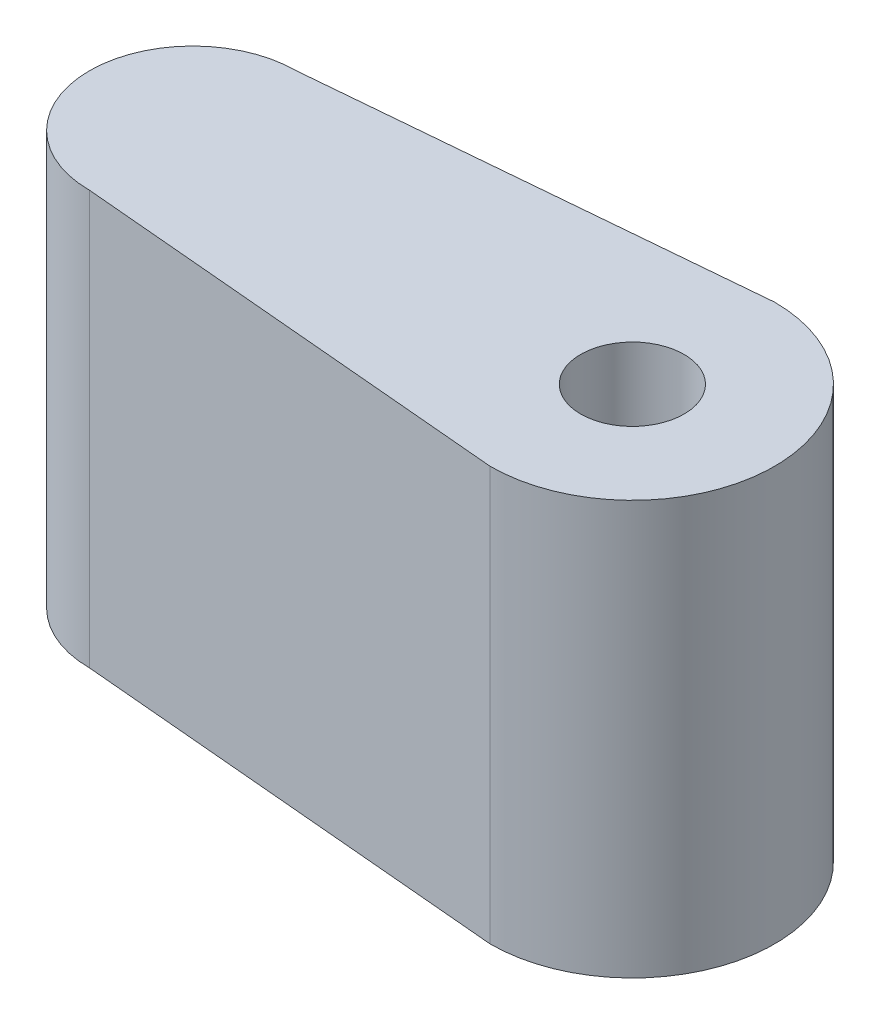
ISO-10303-21;
HEADER;
FILE_DESCRIPTION(('STEP AP214'),'2;1');
FILE_NAME('part.step','',(''),(''),'','','');
FILE_SCHEMA(('AUTOMOTIVE_DESIGN { 1 0 10303 214 1 1 1 1 }'));
ENDSEC;
DATA;
#1=APPLICATION_CONTEXT('core data for automotive mechanical design processes');
#2=APPLICATION_PROTOCOL_DEFINITION('international standard','automotive_design',2000,#1);
#3=PRODUCT_CONTEXT('',#1,'mechanical');
#4=PRODUCT('Part','Part','',(#3));
#5=PRODUCT_RELATED_PRODUCT_CATEGORY('part','',(#4));
#6=PRODUCT_DEFINITION_FORMATION('','',#4);
#7=PRODUCT_DEFINITION_CONTEXT('part definition',#1,'design');
#8=PRODUCT_DEFINITION('design','',#6,#7);
#9=PRODUCT_DEFINITION_SHAPE('','',#8);
#10=(LENGTH_UNIT() NAMED_UNIT(*) SI_UNIT(.MILLI.,.METRE.));
#11=(NAMED_UNIT(*) PLANE_ANGLE_UNIT() SI_UNIT($,.RADIAN.));
#12=(NAMED_UNIT(*) SI_UNIT($,.STERADIAN.) SOLID_ANGLE_UNIT());
#13=UNCERTAINTY_MEASURE_WITH_UNIT(LENGTH_MEASURE(1.E-05),#10,'distance_accuracy_value','');
#14=(GEOMETRIC_REPRESENTATION_CONTEXT(3) GLOBAL_UNCERTAINTY_ASSIGNED_CONTEXT((#13)) GLOBAL_UNIT_ASSIGNED_CONTEXT((#10,
#11,#12)) REPRESENTATION_CONTEXT('',''));
#15=CARTESIAN_POINT('',(0.,0.,0.));
#16=DIRECTION('',(0.,0.,1.));
#17=DIRECTION('',(1.,0.,0.));
#18=AXIS2_PLACEMENT_3D('',#15,#16,#17);
#19=CARTESIAN_POINT('',(-0.240772532188841,8.,-2.72875536480687));
#20=DIRECTION('',(-0.087893810296357,0.,-0.996129850025381));
#21=DIRECTION('',(-0.996129850025381,0.,0.087893810296357));
#22=AXIS2_PLACEMENT_3D('',#19,#20,#21);
#23=PLANE('',#22);
#24=DIRECTION('',(0.996129850025381,0.,-0.087893810296357));
#25=VECTOR('',#24,1.);
#26=CARTESIAN_POINT('',(-0.240772532188841,0.,-2.72875536480687));
#27=LINE('',#26,#25);
#28=CARTESIAN_POINT('',(-8.5,0.,-2.));
#29=VERTEX_POINT('',#28);
#30=CARTESIAN_POINT('',(0.,0.,-2.75));
#31=VERTEX_POINT('',#30);
#32=EDGE_CURVE('E130',#29,#31,#27,.T.);
#33=ORIENTED_EDGE('',*,*,#32,.F.);
#34=DIRECTION('',(0.,-1.,0.));
#35=VECTOR('',#34,1.);
#36=CARTESIAN_POINT('',(-8.5,8.,-2.));
#37=LINE('',#36,#35);
#38=CARTESIAN_POINT('',(-8.5,8.,-2.));
#39=VERTEX_POINT('',#38);
#40=EDGE_CURVE('E56',#39,#29,#37,.T.);
#41=ORIENTED_EDGE('',*,*,#40,.F.);
#42=DIRECTION('',(0.996129850025381,0.,-0.087893810296357));
#43=VECTOR('',#42,1.);
#44=CARTESIAN_POINT('',(-0.240772532188841,8.,-2.72875536480687));
#45=LINE('',#44,#43);
#46=CARTESIAN_POINT('',(0.,8.,-2.75));
#47=VERTEX_POINT('',#46);
#48=EDGE_CURVE('E107',#39,#47,#45,.T.);
#49=ORIENTED_EDGE('',*,*,#48,.T.);
#50=DIRECTION('',(0.,-1.,0.));
#51=VECTOR('',#50,1.);
#52=CARTESIAN_POINT('',(0.,8.,-2.75));
#53=LINE('',#52,#51);
#54=EDGE_CURVE('E87',#47,#31,#53,.T.);
#55=ORIENTED_EDGE('',*,*,#54,.T.);
#56=EDGE_LOOP('',(#33,#41,#49,#55));
#57=FACE_BOUND('',#56,.T.);
#58=ADVANCED_FACE('F41',(#57),#23,.T.);
#59=CARTESIAN_POINT('',(-8.5,8.,0.));
#60=DIRECTION('',(0.,-1.,0.));
#61=DIRECTION('',(0.,0.,-1.));
#62=AXIS2_PLACEMENT_3D('',#59,#60,#61);
#63=CYLINDRICAL_SURFACE('',#62,2.);
#64=CARTESIAN_POINT('',(-10.2320508075689,4.,1.));
#65=CARTESIAN_POINT('',(-10.2320553472846,3.94789219180475,0.999996363074532));
#66=CARTESIAN_POINT('',(-10.2344380118776,3.89571858847495,0.995899970733217));
#67=CARTESIAN_POINT('',(-10.2436236645205,3.79297273532285,0.979723209898053));
#68=CARTESIAN_POINT('',(-10.2504359405556,3.74240408495659,0.967626064554179));
#69=CARTESIAN_POINT('',(-10.267493466054,3.64454833565606,0.936099948699812));
#70=CARTESIAN_POINT('',(-10.2777204347325,3.59724534752641,0.916709952493731));
#71=CARTESIAN_POINT('',(-10.3004266481686,3.50657579800328,0.871267525376372));
#72=CARTESIAN_POINT('',(-10.3129060147606,3.46320944973754,0.845214734035773));
#73=CARTESIAN_POINT('',(-10.3399686905744,3.37769427144249,0.784666540530879));
#74=CARTESIAN_POINT('',(-10.3546406363795,3.33594086432646,0.74965203614377));
#75=CARTESIAN_POINT('',(-10.3837198278571,3.25859161159329,0.673253807614468));
#76=CARTESIAN_POINT('',(-10.3981269383125,3.22299883741648,0.631866925782293));
#77=CARTESIAN_POINT('',(-10.4262147695295,3.15663284885234,0.540489563414546));
#78=CARTESIAN_POINT('',(-10.4397810641817,3.12634623214047,0.490107189012574));
#79=CARTESIAN_POINT('',(-10.4635075609953,3.07485914675424,0.384157026599504));
#80=CARTESIAN_POINT('',(-10.4736699118374,3.05365294386283,0.328592538138155));
#81=CARTESIAN_POINT('',(-10.4888046124424,3.0224953386989,0.218044943925977));
#82=CARTESIAN_POINT('',(-10.4940948022089,3.01185047364447,0.163301790488817));
#83=CARTESIAN_POINT('',(-10.5000758384607,2.99983388132496,0.0525706286978477));
#84=CARTESIAN_POINT('',(-10.5007694678459,2.99845654320429,-0.00341660584373887));
#85=CARTESIAN_POINT('',(-10.4976298191645,3.00474667397035,-0.10983252442375));
#86=CARTESIAN_POINT('',(-10.4941849589216,3.01163801552122,-0.160321199176792));
#87=CARTESIAN_POINT('',(-10.4837424525975,3.03288084390466,-0.259313771918322));
#88=CARTESIAN_POINT('',(-10.4767445406639,3.04723288897622,-0.307817521093926));
#89=CARTESIAN_POINT('',(-10.4597158328765,3.08308256608981,-0.402309391569554));
#90=CARTESIAN_POINT('',(-10.449644415292,3.10467631317207,-0.448253423515178));
#91=CARTESIAN_POINT('',(-10.4273764598669,3.15426341620149,-0.535976801513328));
#92=CARTESIAN_POINT('',(-10.4151791615748,3.18225906330235,-0.577754648838646));
#93=CARTESIAN_POINT('',(-10.3884439439923,3.24689535153302,-0.660173660898195));
#94=CARTESIAN_POINT('',(-10.3737937599818,3.28410302832601,-0.700334075029361));
#95=CARTESIAN_POINT('',(-10.3445434058681,3.36458972493018,-0.77410437029778));
#96=CARTESIAN_POINT('',(-10.3299432826563,3.40787337227406,-0.807709211574231));
#97=CARTESIAN_POINT('',(-10.3014415609248,3.50264819242409,-0.869505334642212));
#98=CARTESIAN_POINT('',(-10.2876431999071,3.55448602305421,-0.897217314978051));
#99=CARTESIAN_POINT('',(-10.2637545027858,3.662937671359,-0.943319113001231));
#100=CARTESIAN_POINT('',(-10.2536603004607,3.71954643301756,-0.961718658210889));
#101=CARTESIAN_POINT('',(-10.2394463581703,3.83121451128279,-0.98718021102504));
#102=CARTESIAN_POINT('',(-10.234916558485,3.88604111904355,-0.995025122119976));
#103=CARTESIAN_POINT('',(-10.2311791936161,3.99640134151654,-1.00151694661143));
#104=CARTESIAN_POINT('',(-10.2319678688931,4.05193442911979,-1.00017035731503));
#105=CARTESIAN_POINT('',(-10.2383433654058,4.15565391857873,-0.989036043343966));
#106=CARTESIAN_POINT('',(-10.2433958750665,4.20397945110793,-0.980187816712467));
#107=CARTESIAN_POINT('',(-10.2569402155134,4.29836778627096,-0.955696284632441));
#108=CARTESIAN_POINT('',(-10.2654331600503,4.34442985074661,-0.940050778623614));
#109=CARTESIAN_POINT('',(-10.2853622207966,4.4354113309027,-0.901647588604886));
#110=CARTESIAN_POINT('',(-10.2969164324306,4.48017901685355,-0.878594063692723));
#111=CARTESIAN_POINT('',(-10.3215611949725,4.56546927153899,-0.826287064015804));
#112=CARTESIAN_POINT('',(-10.3346525335515,4.60598964351328,-0.797030404332216));
#113=CARTESIAN_POINT('',(-10.3628799845634,4.68697876752355,-0.728837167198853));
#114=CARTESIAN_POINT('',(-10.3780658315429,4.72679715071766,-0.689145272314967));
#115=CARTESIAN_POINT('',(-10.4073423497789,4.79941223799359,-0.603404495398289));
#116=CARTESIAN_POINT('',(-10.4214326500771,4.83220657023054,-0.557353474655347));
#117=CARTESIAN_POINT('',(-10.4474136169096,4.8905737259501,-0.458535362558757));
#118=CARTESIAN_POINT('',(-10.4592364167203,4.91593311821091,-0.405623097574113));
#119=CARTESIAN_POINT('',(-10.478833549593,4.95713790385739,-0.295522364641082));
#120=CARTESIAN_POINT('',(-10.4866114367637,4.97299165136631,-0.238337701392176));
#121=CARTESIAN_POINT('',(-10.4966750818188,4.99336856417466,-0.126979682330417));
#122=CARTESIAN_POINT('',(-10.4993992790819,4.99879787587611,-0.0730114438504569));
#123=CARTESIAN_POINT('',(-10.5004213037513,5.0008432654544,0.0351259859512038));
#124=CARTESIAN_POINT('',(-10.4987206806689,4.99746242852356,0.089295100295087));
#125=CARTESIAN_POINT('',(-10.4913396883792,4.98258359320438,0.192537992317147));
#126=CARTESIAN_POINT('',(-10.4859289466799,4.97163515074233,0.241712317811264));
#127=CARTESIAN_POINT('',(-10.4719209366342,4.94267300069703,0.337445952183618));
#128=CARTESIAN_POINT('',(-10.463323211328,4.92465827990655,0.384004884955509));
#129=CARTESIAN_POINT('',(-10.4432593074812,4.88127294783403,0.475423406244885));
#130=CARTESIAN_POINT('',(-10.431686171988,4.85562067679216,0.520125142700046));
#131=CARTESIAN_POINT('',(-10.4068813314183,4.79804206914095,0.604774641814024));
#132=CARTESIAN_POINT('',(-10.3936488655836,4.76611285088433,0.644720207414907));
#133=CARTESIAN_POINT('',(-10.3652861022663,4.6932028609773,0.722914004156891));
#134=CARTESIAN_POINT('',(-10.350097990117,4.65163751252281,0.760597684539272));
#135=CARTESIAN_POINT('',(-10.3206307616285,4.56254927887023,0.828663287394675));
#136=CARTESIAN_POINT('',(-10.3063524576187,4.51502117913232,0.859038750010059));
#137=CARTESIAN_POINT('',(-10.2799960530492,4.41336335341904,0.912431079785654));
#138=CARTESIAN_POINT('',(-10.2680017425627,4.35907246887126,0.935185065960939));
#139=CARTESIAN_POINT('',(-10.2486615632835,4.24666759566022,0.970878709506412));
#140=CARTESIAN_POINT('',(-10.241300161477,4.18856711108731,0.983851191175347));
#141=CARTESIAN_POINT('',(-10.2352927260179,4.108194644348,0.994367007864415));
#142=CARTESIAN_POINT('',(-10.2340812900515,4.08663210560212,0.996476104963851));
#143=CARTESIAN_POINT('',(-10.2324593588775,4.04338351931776,0.999293405089963));
#144=CARTESIAN_POINT('',(-10.2320489172511,4.02169746361413,1.00000151439987));
#145=CARTESIAN_POINT('',(-10.2320508075689,4.,1.));
#146=B_SPLINE_CURVE_WITH_KNOTS('',3,(#64,#65,#66,#67,#68,#69,#70,#71,#72,#73,#74,#75,#76,#77,
#78,#79,#80,#81,#82,#83,#84,#85,#86,#87,#88,#89,#90,#91,#92,#93,#94,#95,#96,#97,#98,#99,#100,
#101,#102,#103,#104,#105,#106,#107,#108,#109,#110,#111,#112,#113,#114,#115,#116,#117,#118,#119,
#120,#121,#122,#123,#124,#125,#126,#127,#128,#129,#130,#131,#132,#133,#134,#135,#136,#137,#138,
#139,#140,#141,#142,#143,#144,#145),.UNSPECIFIED.,.T.,.F.,(4,2,2,2,2,2,2,2,2,2,2,2,2,2,2,2,2,2,
2,2,2,2,2,2,2,2,2,2,2,2,2,2,2,2,2,2,2,2,2,2,4),(0.,0.156232122594716,0.312792892824805,
0.468528595918887,0.62427272544515,0.792862312498234,0.96153571084371,1.14157892238763,
1.32150826963891,1.48863484967935,1.6556602368604,1.80816097484538,1.96067312517455,
2.11529534731147,2.26997299350272,2.43927191456891,2.60870048245919,2.78888841729448,
2.96888774211705,3.13462290854212,3.30024093188373,3.44774183424025,3.59529052436063,
3.74967296406088,3.90413486220047,4.07806743580613,4.25205864978202,4.43064181412966,
4.60906779808772,4.77112270389487,4.93312086793972,5.08444424871493,5.23578933512013,
5.39360750719472,5.55149830100719,5.72510241850068,5.89885942845154,6.07810749038605,
6.2567513300276,6.32180135185309,6.38685572494541),.UNSPECIFIED.);
#147=CARTESIAN_POINT('',(-10.2320508075689,4.,1.));
#148=VERTEX_POINT('',#147);
#149=EDGE_CURVE('E11',#148,#148,#146,.T.);
#150=ORIENTED_EDGE('',*,*,#149,.T.);
#151=EDGE_LOOP('',(#150));
#152=FACE_BOUND('',#151,.T.);
#153=CARTESIAN_POINT('',(-8.5,0.,0.));
#154=DIRECTION('',(0.,1.,0.));
#155=DIRECTION('',(0.,0.,1.));
#156=AXIS2_PLACEMENT_3D('',#153,#154,#155);
#157=CIRCLE('',#156,2.);
#158=CARTESIAN_POINT('',(-8.5,0.,2.));
#159=VERTEX_POINT('',#158);
#160=EDGE_CURVE('E113',#29,#159,#157,.T.);
#161=ORIENTED_EDGE('',*,*,#160,.T.);
#162=DIRECTION('',(0.,-1.,0.));
#163=VECTOR('',#162,1.);
#164=CARTESIAN_POINT('',(-8.5,8.,2.));
#165=LINE('',#164,#163);
#166=CARTESIAN_POINT('',(-8.5,8.,2.));
#167=VERTEX_POINT('',#166);
#168=EDGE_CURVE('E100',#167,#159,#165,.T.);
#169=ORIENTED_EDGE('',*,*,#168,.F.);
#170=CARTESIAN_POINT('',(-8.5,8.,0.));
#171=DIRECTION('',(0.,1.,0.));
#172=DIRECTION('',(0.,0.,1.));
#173=AXIS2_PLACEMENT_3D('',#170,#171,#172);
#174=CIRCLE('',#173,2.);
#175=EDGE_CURVE('E104',#39,#167,#174,.T.);
#176=ORIENTED_EDGE('',*,*,#175,.F.);
#177=ORIENTED_EDGE('',*,*,#40,.T.);
#178=EDGE_LOOP('',(#161,#169,#176,#177));
#179=FACE_BOUND('',#178,.T.);
#180=ADVANCED_FACE('F111',(#152,#179),#63,.T.);
#181=CARTESIAN_POINT('',(-0.240772532188841,8.,2.72875536480687));
#182=DIRECTION('',(0.087893810296357,0.,-0.996129850025381));
#183=DIRECTION('',(-0.996129850025381,0.,-0.087893810296357));
#184=AXIS2_PLACEMENT_3D('',#181,#182,#183);
#185=PLANE('',#184);
#186=DIRECTION('',(0.996129850025381,0.,0.087893810296357));
#187=VECTOR('',#186,1.);
#188=CARTESIAN_POINT('',(-0.240772532188841,0.,2.72875536480687));
#189=LINE('',#188,#187);
#190=CARTESIAN_POINT('',(0.,0.,2.75));
#191=VERTEX_POINT('',#190);
#192=EDGE_CURVE('E125',#159,#191,#189,.T.);
#193=ORIENTED_EDGE('',*,*,#192,.T.);
#194=DIRECTION('',(0.,-1.,0.));
#195=VECTOR('',#194,1.);
#196=CARTESIAN_POINT('',(0.,8.,2.75));
#197=LINE('',#196,#195);
#198=CARTESIAN_POINT('',(0.,8.,2.75));
#199=VERTEX_POINT('',#198);
#200=EDGE_CURVE('E102',#199,#191,#197,.T.);
#201=ORIENTED_EDGE('',*,*,#200,.F.);
#202=DIRECTION('',(0.996129850025381,0.,0.087893810296357));
#203=VECTOR('',#202,1.);
#204=CARTESIAN_POINT('',(-0.240772532188841,8.,2.72875536480687));
#205=LINE('',#204,#203);
#206=EDGE_CURVE('E95',#167,#199,#205,.T.);
#207=ORIENTED_EDGE('',*,*,#206,.F.);
#208=ORIENTED_EDGE('',*,*,#168,.T.);
#209=EDGE_LOOP('',(#193,#201,#207,#208));
#210=FACE_BOUND('',#209,.T.);
#211=ADVANCED_FACE('F98',(#210),#185,.F.);
#212=CARTESIAN_POINT('',(0.,8.,0.));
#213=DIRECTION('',(0.,-1.,0.));
#214=DIRECTION('',(0.,0.,-1.));
#215=AXIS2_PLACEMENT_3D('',#212,#213,#214);
#216=CYLINDRICAL_SURFACE('',#215,1.);
#217=CARTESIAN_POINT('',(0.,8.,0.));
#218=DIRECTION('',(0.,1.,0.));
#219=DIRECTION('',(0.,0.,1.));
#220=AXIS2_PLACEMENT_3D('',#217,#218,#219);
#221=CIRCLE('',#220,1.);
#222=CARTESIAN_POINT('',(0.,8.,1.));
#223=VERTEX_POINT('',#222);
#224=EDGE_CURVE('E124',#223,#223,#221,.T.);
#225=ORIENTED_EDGE('',*,*,#224,.T.);
#226=EDGE_LOOP('',(#225));
#227=FACE_BOUND('',#226,.T.);
#228=CARTESIAN_POINT('',(0.,0.,0.));
#229=DIRECTION('',(0.,1.,0.));
#230=DIRECTION('',(0.,0.,1.));
#231=AXIS2_PLACEMENT_3D('',#228,#229,#230);
#232=CIRCLE('',#231,1.);
#233=CARTESIAN_POINT('',(0.,0.,1.));
#234=VERTEX_POINT('',#233);
#235=EDGE_CURVE('E133',#234,#234,#232,.T.);
#236=ORIENTED_EDGE('',*,*,#235,.F.);
#237=EDGE_LOOP('',(#236));
#238=FACE_BOUND('',#237,.T.);
#239=ADVANCED_FACE('F43',(#227,#238),#216,.F.);
#240=CARTESIAN_POINT('',(0.,8.,0.));
#241=DIRECTION('',(0.,-1.,0.));
#242=DIRECTION('',(0.,0.,-1.));
#243=AXIS2_PLACEMENT_3D('',#240,#241,#242);
#244=CYLINDRICAL_SURFACE('',#243,2.75);
#245=CARTESIAN_POINT('',(0.,0.,0.));
#246=DIRECTION('',(0.,1.,0.));
#247=DIRECTION('',(0.,0.,1.));
#248=AXIS2_PLACEMENT_3D('',#245,#246,#247);
#249=CIRCLE('',#248,2.75);
#250=EDGE_CURVE('E80',#191,#31,#249,.T.);
#251=ORIENTED_EDGE('',*,*,#250,.T.);
#252=ORIENTED_EDGE('',*,*,#54,.F.);
#253=CARTESIAN_POINT('',(0.,8.,0.));
#254=DIRECTION('',(0.,1.,0.));
#255=DIRECTION('',(0.,0.,1.));
#256=AXIS2_PLACEMENT_3D('',#253,#254,#255);
#257=CIRCLE('',#256,2.75);
#258=EDGE_CURVE('E64',#199,#47,#257,.T.);
#259=ORIENTED_EDGE('',*,*,#258,.F.);
#260=ORIENTED_EDGE('',*,*,#200,.T.);
#261=EDGE_LOOP('',(#251,#252,#259,#260));
#262=FACE_BOUND('',#261,.T.);
#263=ADVANCED_FACE('F165',(#262),#244,.T.);
#264=CARTESIAN_POINT('',(0.,8.,0.));
#265=DIRECTION('',(0.,1.,0.));
#266=DIRECTION('',(0.,0.,1.));
#267=AXIS2_PLACEMENT_3D('',#264,#265,#266);
#268=PLANE('',#267);
#269=ORIENTED_EDGE('',*,*,#224,.F.);
#270=EDGE_LOOP('',(#269));
#271=FACE_BOUND('',#270,.T.);
#272=ORIENTED_EDGE('',*,*,#48,.F.);
#273=ORIENTED_EDGE('',*,*,#175,.T.);
#274=ORIENTED_EDGE('',*,*,#206,.T.);
#275=ORIENTED_EDGE('',*,*,#258,.T.);
#276=EDGE_LOOP('',(#272,#273,#274,#275));
#277=FACE_BOUND('',#276,.T.);
#278=ADVANCED_FACE('F106',(#271,#277),#268,.T.);
#279=CARTESIAN_POINT('',(0.,0.,0.));
#280=DIRECTION('',(0.,1.,0.));
#281=DIRECTION('',(0.,0.,1.));
#282=AXIS2_PLACEMENT_3D('',#279,#280,#281);
#283=PLANE('',#282);
#284=ORIENTED_EDGE('',*,*,#235,.T.);
#285=EDGE_LOOP('',(#284));
#286=FACE_BOUND('',#285,.T.);
#287=ORIENTED_EDGE('',*,*,#32,.T.);
#288=ORIENTED_EDGE('',*,*,#250,.F.);
#289=ORIENTED_EDGE('',*,*,#192,.F.);
#290=ORIENTED_EDGE('',*,*,#160,.F.);
#291=EDGE_LOOP('',(#287,#288,#289,#290));
#292=FACE_BOUND('',#291,.T.);
#293=ADVANCED_FACE('F154',(#286,#292),#283,.F.);
#294=CARTESIAN_POINT('',(-2.5,4.,0.));
#295=DIRECTION('',(-1.,0.,0.));
#296=DIRECTION('',(0.,0.,1.));
#297=AXIS2_PLACEMENT_3D('',#294,#295,#296);
#298=CYLINDRICAL_SURFACE('',#297,1.);
#299=CARTESIAN_POINT('',(-2.5,4.,0.));
#300=DIRECTION('',(-1.,0.,0.));
#301=DIRECTION('',(0.,0.,1.));
#302=AXIS2_PLACEMENT_3D('',#299,#300,#301);
#303=CIRCLE('',#302,1.);
#304=CARTESIAN_POINT('',(-2.5,4.,1.));
#305=VERTEX_POINT('',#304);
#306=EDGE_CURVE('E137',#305,#305,#303,.T.);
#307=ORIENTED_EDGE('',*,*,#306,.F.);
#308=EDGE_LOOP('',(#307));
#309=FACE_BOUND('',#308,.T.);
#310=ORIENTED_EDGE('',*,*,#149,.F.);
#311=EDGE_LOOP('',(#310));
#312=FACE_BOUND('',#311,.T.);
#313=ADVANCED_FACE('F151',(#309,#312),#298,.F.);
#314=CARTESIAN_POINT('',(-2.5,4.,0.));
#315=DIRECTION('',(-1.,0.,0.));
#316=DIRECTION('',(0.,0.,1.));
#317=AXIS2_PLACEMENT_3D('',#314,#315,#316);
#318=PLANE('',#317);
#319=ORIENTED_EDGE('',*,*,#306,.T.);
#320=EDGE_LOOP('',(#319));
#321=FACE_BOUND('',#320,.T.);
#322=ADVANCED_FACE('F149',(#321),#318,.T.);
#323=CLOSED_SHELL('',(#58,#180,#211,#239,#263,#278,#293,#313,#322));
#324=MANIFOLD_SOLID_BREP('B2',#323);
#325=ADVANCED_BREP_SHAPE_REPRESENTATION('',(#18,#324),#14);
#326=SHAPE_DEFINITION_REPRESENTATION(#9,#325);
ENDSEC;
END-ISO-10303-21;
